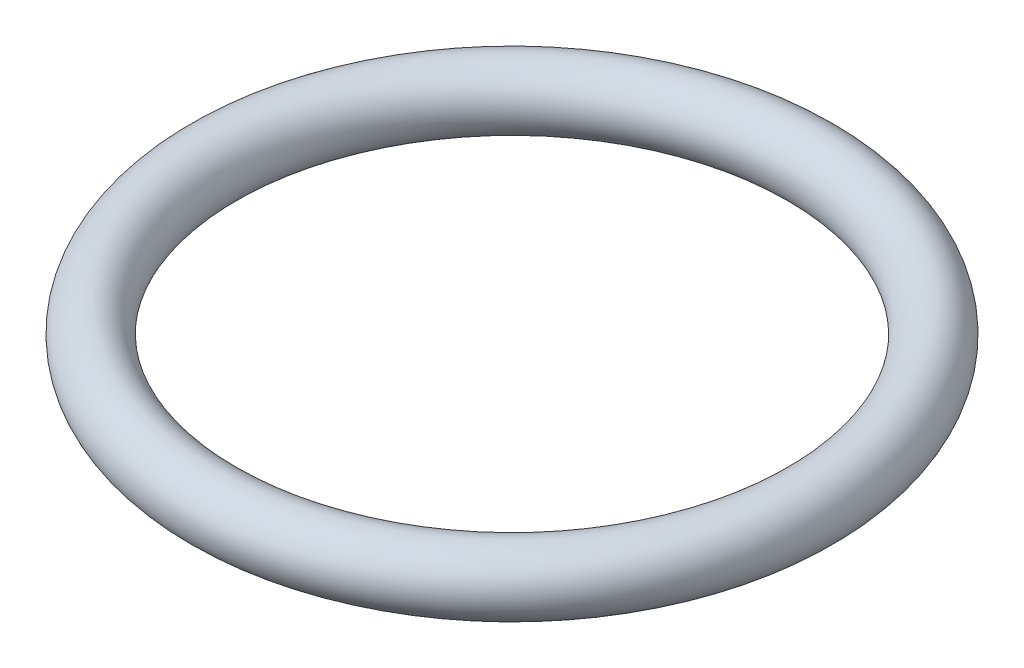
ISO-10303-21;
HEADER;
FILE_DESCRIPTION(('STEP AP214'),'2;1');
FILE_NAME('part.step','',(''),(''),'','','');
FILE_SCHEMA(('AUTOMOTIVE_DESIGN { 1 0 10303 214 1 1 1 1 }'));
ENDSEC;
DATA;
#1=APPLICATION_CONTEXT('core data for automotive mechanical design processes');
#2=APPLICATION_PROTOCOL_DEFINITION('international standard','automotive_design',2000,#1);
#3=PRODUCT_CONTEXT('',#1,'mechanical');
#4=PRODUCT('Part','Part','',(#3));
#5=PRODUCT_RELATED_PRODUCT_CATEGORY('part','',(#4));
#6=PRODUCT_DEFINITION_FORMATION('','',#4);
#7=PRODUCT_DEFINITION_CONTEXT('part definition',#1,'design');
#8=PRODUCT_DEFINITION('design','',#6,#7);
#9=PRODUCT_DEFINITION_SHAPE('','',#8);
#10=(LENGTH_UNIT() NAMED_UNIT(*) SI_UNIT(.MILLI.,.METRE.));
#11=(NAMED_UNIT(*) PLANE_ANGLE_UNIT() SI_UNIT($,.RADIAN.));
#12=(NAMED_UNIT(*) SI_UNIT($,.STERADIAN.) SOLID_ANGLE_UNIT());
#13=UNCERTAINTY_MEASURE_WITH_UNIT(LENGTH_MEASURE(1.E-05),#10,'distance_accuracy_value','');
#14=(GEOMETRIC_REPRESENTATION_CONTEXT(3) GLOBAL_UNCERTAINTY_ASSIGNED_CONTEXT((#13)) GLOBAL_UNIT_ASSIGNED_CONTEXT((#10,
#11,#12)) REPRESENTATION_CONTEXT('',''));
#15=CARTESIAN_POINT('',(0.,0.,0.));
#16=DIRECTION('',(0.,0.,1.));
#17=DIRECTION('',(1.,0.,0.));
#18=AXIS2_PLACEMENT_3D('',#15,#16,#17);
#19=CARTESIAN_POINT('',(0.,0.,0.));
#20=DIRECTION('',(0.,1.,0.));
#21=DIRECTION('',(0.,0.,1.));
#22=AXIS2_PLACEMENT_3D('',#19,#20,#21);
#23=TOROIDAL_SURFACE('',#22,6.6,0.700000000000001);
#24=CARTESIAN_POINT('',(0.,0.,7.3));
#25=VERTEX_POINT('',#24);
#26=VERTEX_LOOP('',#25);
#27=FACE_BOUND('',#26,.T.);
#28=ADVANCED_FACE('F37',(#27),#23,.T.);
#29=CLOSED_SHELL('',(#28));
#30=MANIFOLD_SOLID_BREP('B2',#29);
#31=ADVANCED_BREP_SHAPE_REPRESENTATION('',(#18,#30),#14);
#32=SHAPE_DEFINITION_REPRESENTATION(#9,#31);
ENDSEC;
END-ISO-10303-21;
